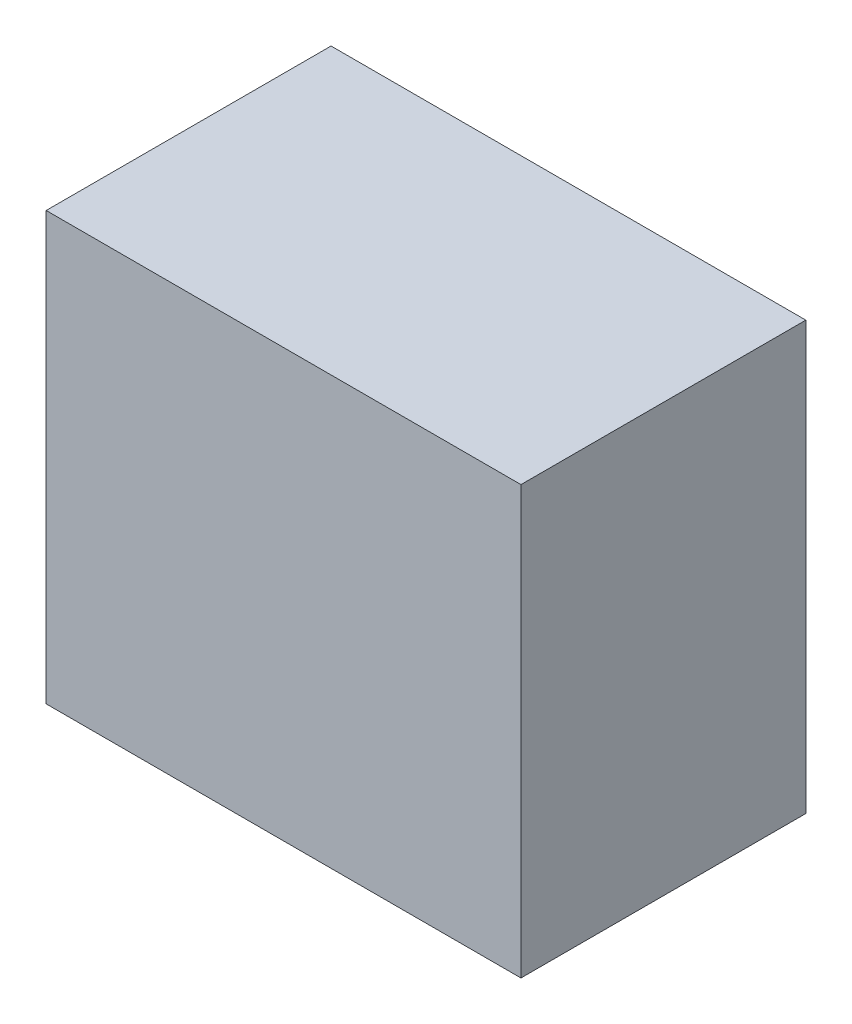
ISO-10303-21;
HEADER;
FILE_DESCRIPTION(('STEP AP214'),'2;1');
FILE_NAME('part.step','',(''),(''),'','','');
FILE_SCHEMA(('AUTOMOTIVE_DESIGN { 1 0 10303 214 1 1 1 1 }'));
ENDSEC;
DATA;
#1=APPLICATION_CONTEXT('core data for automotive mechanical design processes');
#2=APPLICATION_PROTOCOL_DEFINITION('international standard','automotive_design',2000,#1);
#3=PRODUCT_CONTEXT('',#1,'mechanical');
#4=PRODUCT('Part','Part','',(#3));
#5=PRODUCT_RELATED_PRODUCT_CATEGORY('part','',(#4));
#6=PRODUCT_DEFINITION_FORMATION('','',#4);
#7=PRODUCT_DEFINITION_CONTEXT('part definition',#1,'design');
#8=PRODUCT_DEFINITION('design','',#6,#7);
#9=PRODUCT_DEFINITION_SHAPE('','',#8);
#10=(LENGTH_UNIT() NAMED_UNIT(*) SI_UNIT(.MILLI.,.METRE.));
#11=(NAMED_UNIT(*) PLANE_ANGLE_UNIT() SI_UNIT($,.RADIAN.));
#12=(NAMED_UNIT(*) SI_UNIT($,.STERADIAN.) SOLID_ANGLE_UNIT());
#13=UNCERTAINTY_MEASURE_WITH_UNIT(LENGTH_MEASURE(1.E-05),#10,'distance_accuracy_value','');
#14=(GEOMETRIC_REPRESENTATION_CONTEXT(3) GLOBAL_UNCERTAINTY_ASSIGNED_CONTEXT((#13)) GLOBAL_UNIT_ASSIGNED_CONTEXT((#10,
#11,#12)) REPRESENTATION_CONTEXT('',''));
#15=CARTESIAN_POINT('',(0.,0.,0.));
#16=DIRECTION('',(0.,0.,1.));
#17=DIRECTION('',(1.,0.,0.));
#18=AXIS2_PLACEMENT_3D('',#15,#16,#17);
#19=CARTESIAN_POINT('',(508.,457.2,609.6));
#20=DIRECTION('',(-1.,0.,0.));
#21=DIRECTION('',(0.,-1.,0.));
#22=AXIS2_PLACEMENT_3D('',#19,#20,#21);
#23=PLANE('',#22);
#24=DIRECTION('',(0.,1.,0.));
#25=VECTOR('',#24,1.);
#26=CARTESIAN_POINT('',(508.,457.2,0.));
#27=LINE('',#26,#25);
#28=CARTESIAN_POINT('',(508.,-457.2,0.));
#29=VERTEX_POINT('',#28);
#30=CARTESIAN_POINT('',(508.,457.2,0.));
#31=VERTEX_POINT('',#30);
#32=EDGE_CURVE('E100',#29,#31,#27,.T.);
#33=ORIENTED_EDGE('',*,*,#32,.T.);
#34=DIRECTION('',(0.,0.,-1.));
#35=VECTOR('',#34,1.);
#36=CARTESIAN_POINT('',(508.,457.2,609.6));
#37=LINE('',#36,#35);
#38=CARTESIAN_POINT('',(508.,457.2,609.6));
#39=VERTEX_POINT('',#38);
#40=EDGE_CURVE('E11',#39,#31,#37,.T.);
#41=ORIENTED_EDGE('',*,*,#40,.F.);
#42=DIRECTION('',(0.,1.,0.));
#43=VECTOR('',#42,1.);
#44=CARTESIAN_POINT('',(508.,457.2,609.6));
#45=LINE('',#44,#43);
#46=CARTESIAN_POINT('',(508.,-457.2,609.6));
#47=VERTEX_POINT('',#46);
#48=EDGE_CURVE('E88',#47,#39,#45,.T.);
#49=ORIENTED_EDGE('',*,*,#48,.F.);
#50=DIRECTION('',(0.,0.,-1.));
#51=VECTOR('',#50,1.);
#52=CARTESIAN_POINT('',(508.,-457.2,609.6));
#53=LINE('',#52,#51);
#54=EDGE_CURVE('E96',#47,#29,#53,.T.);
#55=ORIENTED_EDGE('',*,*,#54,.T.);
#56=EDGE_LOOP('',(#33,#41,#49,#55));
#57=FACE_BOUND('',#56,.T.);
#58=ADVANCED_FACE('F37',(#57),#23,.F.);
#59=CARTESIAN_POINT('',(-508.,457.2,609.6));
#60=DIRECTION('',(0.,-1.,0.));
#61=DIRECTION('',(0.,0.,-1.));
#62=AXIS2_PLACEMENT_3D('',#59,#60,#61);
#63=PLANE('',#62);
#64=DIRECTION('',(-1.,0.,0.));
#65=VECTOR('',#64,1.);
#66=CARTESIAN_POINT('',(-508.,457.2,0.));
#67=LINE('',#66,#65);
#68=CARTESIAN_POINT('',(-508.,457.2,0.));
#69=VERTEX_POINT('',#68);
#70=EDGE_CURVE('E92',#31,#69,#67,.T.);
#71=ORIENTED_EDGE('',*,*,#70,.T.);
#72=DIRECTION('',(0.,0.,-1.));
#73=VECTOR('',#72,1.);
#74=CARTESIAN_POINT('',(-508.,457.2,609.6));
#75=LINE('',#74,#73);
#76=CARTESIAN_POINT('',(-508.,457.2,609.6));
#77=VERTEX_POINT('',#76);
#78=EDGE_CURVE('E45',#77,#69,#75,.T.);
#79=ORIENTED_EDGE('',*,*,#78,.F.);
#80=DIRECTION('',(-1.,0.,0.));
#81=VECTOR('',#80,1.);
#82=CARTESIAN_POINT('',(-508.,457.2,609.6));
#83=LINE('',#82,#81);
#84=EDGE_CURVE('E83',#39,#77,#83,.T.);
#85=ORIENTED_EDGE('',*,*,#84,.F.);
#86=ORIENTED_EDGE('',*,*,#40,.T.);
#87=EDGE_LOOP('',(#71,#79,#85,#86));
#88=FACE_BOUND('',#87,.T.);
#89=ADVANCED_FACE('F91',(#88),#63,.F.);
#90=CARTESIAN_POINT('',(-508.,457.2,609.6));
#91=DIRECTION('',(1.,0.,0.));
#92=DIRECTION('',(0.,0.,-1.));
#93=AXIS2_PLACEMENT_3D('',#90,#91,#92);
#94=PLANE('',#93);
#95=DIRECTION('',(0.,-1.,0.));
#96=VECTOR('',#95,1.);
#97=CARTESIAN_POINT('',(-508.,457.2,0.));
#98=LINE('',#97,#96);
#99=CARTESIAN_POINT('',(-508.,-457.2,0.));
#100=VERTEX_POINT('',#99);
#101=EDGE_CURVE('E70',#69,#100,#98,.T.);
#102=ORIENTED_EDGE('',*,*,#101,.T.);
#103=DIRECTION('',(0.,0.,-1.));
#104=VECTOR('',#103,1.);
#105=CARTESIAN_POINT('',(-508.,-457.2,609.6));
#106=LINE('',#105,#104);
#107=CARTESIAN_POINT('',(-508.,-457.2,609.6));
#108=VERTEX_POINT('',#107);
#109=EDGE_CURVE('E93',#108,#100,#106,.T.);
#110=ORIENTED_EDGE('',*,*,#109,.F.);
#111=DIRECTION('',(0.,-1.,0.));
#112=VECTOR('',#111,1.);
#113=CARTESIAN_POINT('',(-508.,457.2,609.6));
#114=LINE('',#113,#112);
#115=EDGE_CURVE('E86',#77,#108,#114,.T.);
#116=ORIENTED_EDGE('',*,*,#115,.F.);
#117=ORIENTED_EDGE('',*,*,#78,.T.);
#118=EDGE_LOOP('',(#102,#110,#116,#117));
#119=FACE_BOUND('',#118,.T.);
#120=ADVANCED_FACE('F94',(#119),#94,.F.);
#121=CARTESIAN_POINT('',(-508.,-457.2,609.6));
#122=DIRECTION('',(0.,1.,0.));
#123=DIRECTION('',(0.,0.,1.));
#124=AXIS2_PLACEMENT_3D('',#121,#122,#123);
#125=PLANE('',#124);
#126=DIRECTION('',(1.,0.,0.));
#127=VECTOR('',#126,1.);
#128=CARTESIAN_POINT('',(-508.,-457.2,0.));
#129=LINE('',#128,#127);
#130=EDGE_CURVE('E76',#100,#29,#129,.T.);
#131=ORIENTED_EDGE('',*,*,#130,.T.);
#132=ORIENTED_EDGE('',*,*,#54,.F.);
#133=DIRECTION('',(1.,0.,0.));
#134=VECTOR('',#133,1.);
#135=CARTESIAN_POINT('',(-508.,-457.2,609.6));
#136=LINE('',#135,#134);
#137=EDGE_CURVE('E53',#108,#47,#136,.T.);
#138=ORIENTED_EDGE('',*,*,#137,.F.);
#139=ORIENTED_EDGE('',*,*,#109,.T.);
#140=EDGE_LOOP('',(#131,#132,#138,#139));
#141=FACE_BOUND('',#140,.T.);
#142=ADVANCED_FACE('F107',(#141),#125,.F.);
#143=CARTESIAN_POINT('',(0.,0.,609.6));
#144=DIRECTION('',(0.,0.,1.));
#145=DIRECTION('',(1.,0.,0.));
#146=AXIS2_PLACEMENT_3D('',#143,#144,#145);
#147=PLANE('',#146);
#148=ORIENTED_EDGE('',*,*,#48,.T.);
#149=ORIENTED_EDGE('',*,*,#84,.T.);
#150=ORIENTED_EDGE('',*,*,#115,.T.);
#151=ORIENTED_EDGE('',*,*,#137,.T.);
#152=EDGE_LOOP('',(#148,#149,#150,#151));
#153=FACE_BOUND('',#152,.T.);
#154=ADVANCED_FACE('F84',(#153),#147,.T.);
#155=CARTESIAN_POINT('',(0.,0.,0.));
#156=DIRECTION('',(0.,0.,1.));
#157=DIRECTION('',(1.,0.,0.));
#158=AXIS2_PLACEMENT_3D('',#155,#156,#157);
#159=PLANE('',#158);
#160=ORIENTED_EDGE('',*,*,#32,.F.);
#161=ORIENTED_EDGE('',*,*,#130,.F.);
#162=ORIENTED_EDGE('',*,*,#101,.F.);
#163=ORIENTED_EDGE('',*,*,#70,.F.);
#164=EDGE_LOOP('',(#160,#161,#162,#163));
#165=FACE_BOUND('',#164,.T.);
#166=ADVANCED_FACE('F110',(#165),#159,.F.);
#167=CLOSED_SHELL('',(#58,#89,#120,#142,#154,#166));
#168=MANIFOLD_SOLID_BREP('B2',#167);
#169=ADVANCED_BREP_SHAPE_REPRESENTATION('',(#18,#168),#14);
#170=SHAPE_DEFINITION_REPRESENTATION(#9,#169);
ENDSEC;
END-ISO-10303-21;
